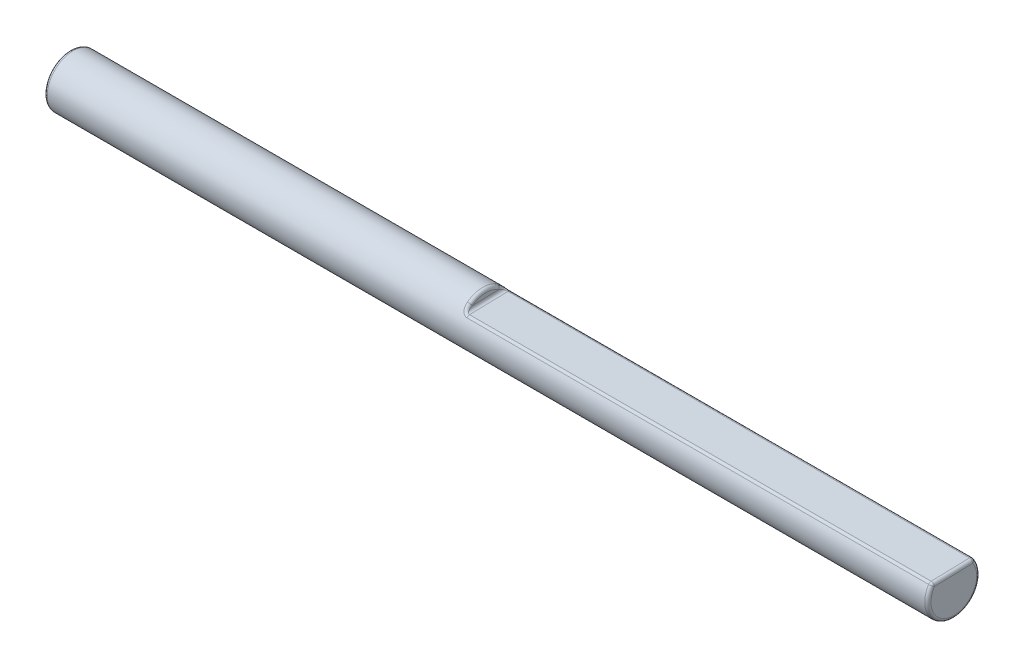
ISO-10303-21;
HEADER;
FILE_DESCRIPTION(('STEP AP214'),'2;1');
FILE_NAME('part.step','',(''),(''),'','','');
FILE_SCHEMA(('AUTOMOTIVE_DESIGN { 1 0 10303 214 1 1 1 1 }'));
ENDSEC;
DATA;
#1=APPLICATION_CONTEXT('core data for automotive mechanical design processes');
#2=APPLICATION_PROTOCOL_DEFINITION('international standard','automotive_design',2000,#1);
#3=PRODUCT_CONTEXT('',#1,'mechanical');
#4=PRODUCT('Part','Part','',(#3));
#5=PRODUCT_RELATED_PRODUCT_CATEGORY('part','',(#4));
#6=PRODUCT_DEFINITION_FORMATION('','',#4);
#7=PRODUCT_DEFINITION_CONTEXT('part definition',#1,'design');
#8=PRODUCT_DEFINITION('design','',#6,#7);
#9=PRODUCT_DEFINITION_SHAPE('','',#8);
#10=(LENGTH_UNIT() NAMED_UNIT(*) SI_UNIT(.MILLI.,.METRE.));
#11=(NAMED_UNIT(*) PLANE_ANGLE_UNIT() SI_UNIT($,.RADIAN.));
#12=(NAMED_UNIT(*) SI_UNIT($,.STERADIAN.) SOLID_ANGLE_UNIT());
#13=UNCERTAINTY_MEASURE_WITH_UNIT(LENGTH_MEASURE(1.E-05),#10,'distance_accuracy_value','');
#14=(GEOMETRIC_REPRESENTATION_CONTEXT(3) GLOBAL_UNCERTAINTY_ASSIGNED_CONTEXT((#13)) GLOBAL_UNIT_ASSIGNED_CONTEXT((#10,
#11,#12)) REPRESENTATION_CONTEXT('',''));
#15=CARTESIAN_POINT('',(0.,0.,0.));
#16=DIRECTION('',(0.,0.,1.));
#17=DIRECTION('',(1.,0.,0.));
#18=AXIS2_PLACEMENT_3D('',#15,#16,#17);
#19=CARTESIAN_POINT('',(107.95,0.,0.));
#20=DIRECTION('',(-1.,0.,0.));
#21=DIRECTION('',(0.,0.,1.));
#22=AXIS2_PLACEMENT_3D('',#19,#20,#21);
#23=CYLINDRICAL_SURFACE('',#22,3.175);
#24=CARTESIAN_POINT('',(0.381000000000006,0.,0.));
#25=DIRECTION('',(1.,0.,0.));
#26=DIRECTION('',(0.,0.,-1.));
#27=AXIS2_PLACEMENT_3D('',#24,#25,#26);
#28=CIRCLE('',#27,3.175);
#29=CARTESIAN_POINT('',(0.381000000000006,0.,-3.175));
#30=VERTEX_POINT('',#29);
#31=EDGE_CURVE('E273',#30,#30,#28,.T.);
#32=ORIENTED_EDGE('',*,*,#31,.T.);
#33=EDGE_LOOP('',(#32));
#34=FACE_BOUND('',#33,.T.);
#35=CARTESIAN_POINT('',(51.2889113464813,1.86061677622849,2.36945052063749));
#36=CARTESIAN_POINT('',(51.3264620396878,1.8664609920511,2.57606934951021));
#37=CARTESIAN_POINT('',(51.3968226929626,1.69924548178732,2.68201226556207));
#38=CARTESIAN_POINT('',(51.2716276856336,1.85531270441578,2.37616676666429));
#39=CARTESIAN_POINT('',(51.303375282423,1.85749105612046,2.58277024156461));
#40=CARTESIAN_POINT('',(51.3622553712666,1.68738842412367,2.68949626337339));
#41=CARTESIAN_POINT('',(51.253810924238,1.85128223441124,2.38121692365727));
#42=CARTESIAN_POINT('',(51.2793882237581,1.85068500253967,2.58781753681003));
#43=CARTESIAN_POINT('',(51.3266218484758,1.67837691595813,2.69512250049785));
#44=CARTESIAN_POINT('',(51.2176628451154,1.84587687221378,2.38795387459997));
#45=CARTESIAN_POINT('',(51.2306157818434,1.84157359403442,2.59454953766819));
#46=CARTESIAN_POINT('',(51.254325690231,1.66629032446794,2.70262711959848));
#47=CARTESIAN_POINT('',(51.1993321068419,1.84449910257518,2.38964431297881));
#48=CARTESIAN_POINT('',(51.2058012442463,1.83925197265389,2.59624634845099));
#49=CARTESIAN_POINT('',(51.2176642136843,1.66320880874467,2.70450956262816));
#50=CARTESIAN_POINT('',(51.1624786529568,1.84449552930852,2.38964534121022));
#51=CARTESIAN_POINT('',(51.1559427111945,1.83924541956583,2.59624879138466));
#52=CARTESIAN_POINT('',(51.143957305913,1.66320071994776,2.70451062871122));
#53=CARTESIAN_POINT('',(51.1439559089441,1.84589828072248,2.3879208611442));
#54=CARTESIAN_POINT('',(51.1308680865988,1.84160861468443,2.59451922324205));
#55=CARTESIAN_POINT('',(51.1069118178863,1.66633801200165,2.70259019769311));
#56=CARTESIAN_POINT('',(51.1074745013587,1.85142600111972,2.38104446763984));
#57=CARTESIAN_POINT('',(51.0816486169153,1.85092869396238,2.58764220598248));
#58=CARTESIAN_POINT('',(51.0339490027194,1.67869857779526,2.69493054907568));
#59=CARTESIAN_POINT('',(51.0895156565798,1.8555500860408,2.37589366728384));
#60=CARTESIAN_POINT('',(51.0574728002052,1.85789594340085,2.5824870818938));
#61=CARTESIAN_POINT('',(50.9980313131668,1.68791987506303,2.68919257165323));
#62=CARTESIAN_POINT('',(51.0547078075911,1.86628287038285,2.36224541373698));
#63=CARTESIAN_POINT('',(51.0109290954819,1.87606450098341,2.56887370326151));
#64=CARTESIAN_POINT('',(50.928415615175,1.71191094840253,2.67398282988706));
#65=CARTESIAN_POINT('',(51.0378561737102,1.87288541272295,2.35375625136794));
#66=CARTESIAN_POINT('',(50.9885283498056,1.88727939537419,2.56040524868403));
#67=CARTESIAN_POINT('',(50.8947123473936,1.72666697481243,2.66452031537807));
#68=CARTESIAN_POINT('',(51.0056058699795,1.88824233783816,2.33353659065094));
#69=CARTESIAN_POINT('',(50.9461400200386,1.91343730516875,2.54031499979632));
#70=CARTESIAN_POINT('',(50.8302117399579,1.76097448524634,2.641971655952));
#71=CARTESIAN_POINT('',(50.9902095857453,1.89700017172521,2.32180089007985));
#72=CARTESIAN_POINT('',(50.9261330136026,1.92842247979147,2.52865914842708));
#73=CARTESIAN_POINT('',(50.7994191715348,1.7805336600944,2.62887969517106));
#74=CARTESIAN_POINT('',(50.9607241196294,1.91655090994752,2.29484670019643));
#75=CARTESIAN_POINT('',(50.8885031415294,1.96198733713377,2.50200106090461));
#76=CARTESIAN_POINT('',(50.740448239213,1.82417519910743,2.59879421738565));
#77=CARTESIAN_POINT('',(50.9466938216674,1.92740079294856,2.27952725029035));
#78=CARTESIAN_POINT('',(50.8709667890501,1.98071569139524,2.48686134279981));
#79=CARTESIAN_POINT('',(50.7123876431477,1.84838410573956,2.58168754224174));
#80=CARTESIAN_POINT('',(50.92069636433,1.95044233090003,2.24590286258762));
#81=CARTESIAN_POINT('',(50.8394282094077,2.02063141439924,2.45378195785048));
#82=CARTESIAN_POINT('',(50.660392728466,1.89976428689574,2.54411811476548));
#83=CARTESIAN_POINT('',(50.90873157848,1.96263550345286,2.22759453657761));
#84=CARTESIAN_POINT('',(50.8254278039632,2.04188053771935,2.43578407032227));
#85=CARTESIAN_POINT('',(50.6364631569006,1.92693891165497,2.52365155349101));
#86=CARTESIAN_POINT('',(50.8827938803284,1.99264886394887,2.1808885782048));
#87=CARTESIAN_POINT('',(50.7964779101286,2.0944753687885,2.38998506591887));
#88=CARTESIAN_POINT('',(50.5845877607386,1.99378163171356,2.47140825448484));
#89=CARTESIAN_POINT('',(50.8697674359335,2.01085591234255,2.15129100670113));
#90=CARTESIAN_POINT('',(50.7832722093846,2.12660683697859,2.36102216723602));
#91=CARTESIAN_POINT('',(50.5585348718877,2.03429405335518,2.43827823086114));
#92=CARTESIAN_POINT('',(50.8474914781523,2.04782943375369,2.08793927786675));
#93=CARTESIAN_POINT('',(50.763655442702,2.1921565369996,2.29941171032207));
#94=CARTESIAN_POINT('',(50.5139829562839,2.11646998902107,2.36730788375925));
#95=CARTESIAN_POINT('',(50.8382463028738,2.06659652295876,2.05418040386822));
#96=CARTESIAN_POINT('',(50.7573419075053,2.22571762123843,2.26658152208576));
#97=CARTESIAN_POINT('',(50.4954926057465,2.1581347669446,2.32946221475156));
#98=CARTESIAN_POINT('',(50.8200767324406,2.11127559581753,1.96934888447875));
#99=CARTESIAN_POINT('',(50.7495916814408,2.30634325466988,2.18416014327291));
#100=CARTESIAN_POINT('',(50.4591534648827,2.25719798063517,2.23428957702656));
#101=CARTESIAN_POINT('',(50.8127131041597,2.13709014841927,1.91669422351017));
#102=CARTESIAN_POINT('',(50.7514088708258,2.35328761028631,2.1331392674937));
#103=CARTESIAN_POINT('',(50.4444262082862,2.31432941245922,2.17516089294884));
#104=CARTESIAN_POINT('',(50.8029629166156,2.18716484872636,1.80640004855309));
#105=CARTESIAN_POINT('',(50.7649453938521,2.44503082507211,2.02690729169339));
#106=CARTESIAN_POINT('',(50.4249258332647,2.42491686404693,2.05119042107963));
#107=CARTESIAN_POINT('',(50.8006063710277,2.21141478255827,1.74873261886379));
#108=CARTESIAN_POINT('',(50.7771512057677,2.48993644770661,1.97126510354332));
#109=CARTESIAN_POINT('',(50.4202127421912,2.47834887258039,1.9863165957711));
#110=CARTESIAN_POINT('',(50.7996997300512,2.25308918931056,1.64154501717415));
#111=CARTESIAN_POINT('',(50.8063065780548,2.5675813512571,1.86856339253273));
#112=CARTESIAN_POINT('',(50.4183994599932,2.56994052925047,1.86563624935162));
#113=CARTESIAN_POINT('',(50.8004940123679,2.27091978608572,1.59264377162257));
#114=CARTESIAN_POINT('',(50.8222093303457,2.60124831444893,1.82140194567038));
#115=CARTESIAN_POINT('',(50.4199880243634,2.60904074450168,1.81054522403829));
#116=CARTESIAN_POINT('',(50.8038892506501,2.30498944125461,1.49291444033795));
#117=CARTESIAN_POINT('',(50.8585085124755,2.66631382468721,1.72508979460887));
#118=CARTESIAN_POINT('',(50.4267785009295,2.68356961941779,1.69812625423315));
#119=CARTESIAN_POINT('',(50.8064925353414,2.32122641740139,1.44208395091787));
#120=CARTESIAN_POINT('',(50.8791200444994,2.69765457973563,1.67579499349746));
#121=CARTESIAN_POINT('',(50.4319850705777,2.718993478883,1.64079551644433));
#122=CARTESIAN_POINT('',(50.8129252595926,2.35173838787002,1.33979125008394));
#123=CARTESIAN_POINT('',(50.9236828364736,2.75740753118696,1.57615280226639));
#124=CARTESIAN_POINT('',(50.4448505192883,2.78536536104796,1.52535910882584));
#125=CARTESIAN_POINT('',(50.8167316771751,2.36604354938308,1.28835707996335));
#126=CARTESIAN_POINT('',(50.9477540223914,2.78579308492648,1.52569960894811));
#127=CARTESIAN_POINT('',(50.4524633544017,2.81638273242603,1.46728619497698));
#128=CARTESIAN_POINT('',(50.8251335397235,2.3929742143745,1.18429308388462));
#129=CARTESIAN_POINT('',(50.9988637336602,2.84029317299343,1.42251192748724));
#130=CARTESIAN_POINT('',(50.4692670793957,2.87456680695641,1.34973233304561));
#131=CARTESIAN_POINT('',(50.8297267183352,2.40560436247825,1.13166705892288));
#132=CARTESIAN_POINT('',(51.0260182991249,2.86629149250079,1.36970693172966));
#133=CARTESIAN_POINT('',(50.4784534365679,2.90174417233005,1.29025584106035));
#134=CARTESIAN_POINT('',(50.8345010351724,2.41740942277435,1.07845527244791));
#135=CARTESIAN_POINT('',(51.053542503335,2.89057483799126,1.31683559197639));
#136=CARTESIAN_POINT('',(50.4880020703448,2.92703004363376,1.23008947791018));
#137=(BOUNDED_SURFACE() B_SPLINE_SURFACE(3,2,((#35,#36,#37),(#38,#39,#40),(#41,#42,#43),(#44,
#45,#46),(#47,#48,#49),(#50,#51,#52),(#53,#54,#55),(#56,#57,#58),(#59,#60,#61),(#62,#63,#64),
(#65,#66,#67),(#68,#69,#70),(#71,#72,#73),(#74,#75,#76),(#77,#78,#79),(#80,#81,#82),(#83,#84,
#85),(#86,#87,#88),(#89,#90,#91),(#92,#93,#94),(#95,#96,#97),(#98,#99,#100),(#101,#102,#103),
(#104,#105,#106),(#107,#108,#109),(#110,#111,#112),(#113,#114,#115),(#116,#117,#118),(#119,#120,
#121),(#122,#123,#124),(#125,#126,#127),(#128,#129,#130),(#131,#132,#133),(#134,#135,#136)),
.UNSPECIFIED.,.F.,.F.,.F.) B_SPLINE_SURFACE_WITH_KNOTS((4,2,2,2,2,2,2,2,2,2,2,2,2,2,2,2,4),(3,
3),(0.,0.109979605014101,0.219839845237583,0.330834159910739,0.441792434311733,
0.552476866686738,0.663339696503116,0.777812327617677,0.892415638572016,1.05027319729736,
1.20831135545631,1.42859982924447,1.65020508343154,1.82836901100806,2.00676271461984,
2.18193077376075,2.35660247596007),(0.,1.),
.UNSPECIFIED.) GEOMETRIC_REPRESENTATION_ITEM() RATIONAL_B_SPLINE_SURFACE(((1.,0.875696525181189,
1.),(1.,0.876819204022841,1.),(1.,0.877647414738648,1.),(1.,0.87874140112617,1.),(1.,
0.87900778625312,1.),(1.,0.879006937081256,1.),(1.,0.878734165904822,1.),(1.,0.877621403045872,
1.),(1.,0.876781595570751,1.),(1.,0.874483221090066,1.),(1.,0.873026186281496,1.),(1.,
0.869421553804353,1.),(1.,0.867272846894886,1.),(1.,0.862141294560382,1.),(1.,0.859133566871117,
1.),(1.,0.852278123703959,1.),(1.,0.848429453231229,1.),(1.,0.838277208471231,1.),(1.,
0.831595334164917,1.),(1.,0.816756892948541,1.),(1.,0.808598647638926,1.),(1.,0.78754094815492,
1.),(1.,0.774039732630418,1.),(1.,0.745150665958184,1.),(1.,0.729752019803922,1.),(1.,
0.700926713202263,1.),(1.,0.687705220781478,1.),(1.,0.660816578297559,1.),(1.,0.647148875465996,
1.),(1.,0.619959656878175,1.),(1.,0.60643996640438,1.),(1.,0.579679073015139,1.),(1.,
0.566437189530008,1.),(1.,0.553482817324469,1.))) REPRESENTATION_ITEM('') SURFACE());
#138=CARTESIAN_POINT('',(50.4880020703448,2.92703004363376,1.23008947791018));
#139=CARTESIAN_POINT('',(50.4784534365679,2.90174417233005,1.29025584106035));
#140=CARTESIAN_POINT('',(50.4692670793957,2.87456680695641,1.34973233304561));
#141=CARTESIAN_POINT('',(50.4524633544017,2.81638273242603,1.46728619497698));
#142=CARTESIAN_POINT('',(50.4448505192883,2.78536536104796,1.52535910882584));
#143=CARTESIAN_POINT('',(50.4319850705777,2.71899347888301,1.64079551644433));
#144=CARTESIAN_POINT('',(50.4267785009295,2.68356961941779,1.69812625423315));
#145=CARTESIAN_POINT('',(50.4199880243634,2.60904074450168,1.81054522403829));
#146=CARTESIAN_POINT('',(50.4183994599932,2.56994052925047,1.86563624935162));
#147=CARTESIAN_POINT('',(50.4202127421912,2.47834887258039,1.9863165957711));
#148=CARTESIAN_POINT('',(50.4249258332647,2.42491686404693,2.05119042107963));
#149=CARTESIAN_POINT('',(50.4444262082862,2.31432941245922,2.17516089294884));
#150=CARTESIAN_POINT('',(50.4591534648827,2.25719798063517,2.23428957702656));
#151=CARTESIAN_POINT('',(50.4954926057465,2.1581347669446,2.32946221475156));
#152=CARTESIAN_POINT('',(50.5139829562839,2.11646998902107,2.36730788375925));
#153=CARTESIAN_POINT('',(50.5585348718877,2.03429405335518,2.43827823086114));
#154=CARTESIAN_POINT('',(50.5845877607386,1.99378163171356,2.47140825448484));
#155=CARTESIAN_POINT('',(50.6364631569006,1.92693891165497,2.52365155349101));
#156=CARTESIAN_POINT('',(50.660392728466,1.89976428689574,2.54411811476548));
#157=CARTESIAN_POINT('',(50.7123876431477,1.84838410573956,2.58168754224174));
#158=CARTESIAN_POINT('',(50.740448239213,1.82417519910743,2.59879421738565));
#159=CARTESIAN_POINT('',(50.7994191715348,1.7805336600944,2.62887969517106));
#160=CARTESIAN_POINT('',(50.8302117399579,1.76097448524634,2.641971655952));
#161=CARTESIAN_POINT('',(50.8947123473936,1.72666697481243,2.66452031537807));
#162=CARTESIAN_POINT('',(50.928415615175,1.71191094840253,2.67398282988706));
#163=CARTESIAN_POINT('',(50.9980313131668,1.68791987506303,2.68919257165323));
#164=CARTESIAN_POINT('',(51.0339490027194,1.67869857779526,2.69493054907568));
#165=CARTESIAN_POINT('',(51.1069118178863,1.66633801200165,2.70259019769311));
#166=CARTESIAN_POINT('',(51.143957305913,1.66320071994776,2.70451062871122));
#167=CARTESIAN_POINT('',(51.2176642136843,1.66320880874467,2.70450956262816));
#168=CARTESIAN_POINT('',(51.254325690231,1.66629032446794,2.70262711959848));
#169=CARTESIAN_POINT('',(51.3266218484758,1.67837691595813,2.69512250049785));
#170=CARTESIAN_POINT('',(51.3622553712666,1.68738842412367,2.68949626337339));
#171=CARTESIAN_POINT('',(51.3968226929626,1.69924548178732,2.68201226556207));
#172=B_SPLINE_CURVE_WITH_KNOTS('',3,(#138,#139,#140,#141,#142,#143,#144,#145,#146,#147,#148,
#149,#150,#151,#152,#153,#154,#155,#156,#157,#158,#159,#160,#161,#162,#163,#164,#165,#166,#167,
#168,#169,#170,#171),.UNSPECIFIED.,.F.,.F.,(4,2,2,2,2,2,2,2,2,2,2,2,2,2,2,2,4),(0.,
0.174671702199319,0.349839761340232,0.52823346495201,0.706397392528534,0.928002646715598,
1.14829112050376,1.30632927866271,1.46418683738806,1.5787901483424,1.69326277945696,
1.80412560927333,1.91481004164834,2.02576831604933,2.13676263072249,2.24662287094597,
2.35660247596007),.UNSPECIFIED.);
#173=CARTESIAN_POINT('',(50.419,2.55004648338834,1.89153057933484));
#174=VERTEX_POINT('',#173);
#175=CARTESIAN_POINT('',(51.181,1.66320478511395,2.70451009293255));
#176=VERTEX_POINT('',#175);
#177=EDGE_CURVE('E267',#174,#176,#172,.T.);
#178=ORIENTED_EDGE('',*,*,#177,.F.);
#179=CARTESIAN_POINT('',(50.419,0.,0.));
#180=DIRECTION('',(-1.,0.,0.));
#181=DIRECTION('',(0.,0.,1.));
#182=AXIS2_PLACEMENT_3D('',#179,#180,#181);
#183=CIRCLE('',#182,3.175);
#184=CARTESIAN_POINT('',(50.419,2.64280139391695,-1.75960955677975));
#185=VERTEX_POINT('',#184);
#186=EDGE_CURVE('E103',#174,#185,#183,.T.);
#187=ORIENTED_EDGE('',*,*,#186,.T.);
#188=CARTESIAN_POINT('',(50.8366905023827,2.47313278792479,-0.929790084784356));
#189=CARTESIAN_POINT('',(51.0664734733044,2.96369122443615,-1.14301851228131));
#190=CARTESIAN_POINT('',(50.4923810047653,2.99569537312775,-1.05187177518031));
#191=CARTESIAN_POINT('',(50.8319019684397,2.46437474302006,-0.983264972040821));
#192=CARTESIAN_POINT('',(51.0388431863217,2.94265705359688,-1.19707037018806));
#193=CARTESIAN_POINT('',(50.4828039368059,2.9742543950184,-1.11293055452863));
#194=CARTESIAN_POINT('',(50.8272624690788,2.45477757696794,-1.03621001373454));
#195=CARTESIAN_POINT('',(51.0115031225493,2.91994457885805,-1.25108863702687));
#196=CARTESIAN_POINT('',(50.4735249381208,2.95092222441763,-1.17341105694561));
#197=CARTESIAN_POINT('',(50.8186892705911,2.43388562169779,-1.14102346267586));
#198=CARTESIAN_POINT('',(50.9598467979093,2.87193959302793,-1.35678020802059));
#199=CARTESIAN_POINT('',(50.4563785412191,2.90043195384652,-1.29319680086037));
#200=CARTESIAN_POINT('',(50.8147573756501,2.42258662422196,-1.19288882775468));
#201=CARTESIAN_POINT('',(50.9354262066966,2.84677023994149,-1.40851008729006));
#202=CARTESIAN_POINT('',(50.4485147513741,2.87326438050473,-1.35249870452667));
#203=CARTESIAN_POINT('',(50.8079566034907,2.39803114103891,-1.29645583950263));
#204=CARTESIAN_POINT('',(50.8898623196213,2.79330806338998,-1.51110560413029));
#205=CARTESIAN_POINT('',(50.4349132069055,2.8144865549075,-1.47097282171677));
#206=CARTESIAN_POINT('',(50.8051148175835,2.38473496399274,-1.34812512319508));
#207=CARTESIAN_POINT('',(50.8686188962066,2.76503432555879,-1.56206901829057));
#208=CARTESIAN_POINT('',(50.4292296348989,2.78278705782587,-1.53010938050571));
#209=CARTESIAN_POINT('',(50.8011384346416,2.35644960446841,-1.44969228552826));
#210=CARTESIAN_POINT('',(50.8308901831387,2.70598038527811,-1.66187338182173));
#211=CARTESIAN_POINT('',(50.4212768690133,2.71559266983258,-1.64641708269041));
#212=CARTESIAN_POINT('',(50.8000019744405,2.34146228894075,-1.49959203917676));
#213=CARTESIAN_POINT('',(50.8141969196926,2.67527084306931,-1.71084799126658));
#214=CARTESIAN_POINT('',(50.4190039488012,2.68010196652802,-1.70359030428956));
#215=CARTESIAN_POINT('',(50.7999972238099,2.30345354349339,-1.61716285052348));
#216=CARTESIAN_POINT('',(50.7808943816749,2.59910537279674,-1.82523082391367));
#217=CARTESIAN_POINT('',(50.4189944477321,2.59035439555285,-1.83837622007862));
#218=CARTESIAN_POINT('',(50.8022373446047,2.27964097768128,-1.68382232215996));
#219=CARTESIAN_POINT('',(50.766210276487,2.55198508508872,-1.8908185457887));
#220=CARTESIAN_POINT('',(50.4234746892161,2.53432925583875,-1.91486146749265));
#221=CARTESIAN_POINT('',(50.8130834683634,2.2297090887604,-1.81076112732047));
#222=CARTESIAN_POINT('',(50.7507213830287,2.45497751815753,-2.01558647679361));
#223=CARTESIAN_POINT('',(50.4451669367202,2.4172221038779,-2.06064367928652));
#224=CARTESIAN_POINT('',(50.8216317880889,2.20361254448583,-1.87109265147976));
#225=CARTESIAN_POINT('',(50.7491923300968,2.40498959580597,-2.07538897589359));
#226=CARTESIAN_POINT('',(50.4622635762618,2.35619033931358,-2.12999933228784));
#227=CARTESIAN_POINT('',(50.841931751241,2.16135772100504,-1.96069216875758));
#228=CARTESIAN_POINT('',(50.7597988918809,2.32503752005264,-2.1646831757065));
#229=CARTESIAN_POINT('',(50.5028635024318,2.25760267407526,-2.2331016851402));
#230=CARTESIAN_POINT('',(50.8510161119943,2.14541948765644,-1.99270116650551));
#231=CARTESIAN_POINT('',(50.7665067335088,2.29530187505624,-2.19654788923173));
#232=CARTESIAN_POINT('',(50.5210322238258,2.22046763862043,-2.2699588237116));
#233=CARTESIAN_POINT('',(50.8725439006968,2.11390174586578,-2.05301756447317));
#234=CARTESIAN_POINT('',(50.7860729430861,2.23711937049072,-2.25663718827951));
#235=CARTESIAN_POINT('',(50.5640878013179,2.14711938041226,-2.33945367830609));
#236=CARTESIAN_POINT('',(50.8849895631031,2.09832248355702,-2.08132248372334));
#237=CARTESIAN_POINT('',(50.7988658365802,2.20856141987183,-2.2850125711189));
#238=CARTESIAN_POINT('',(50.5889791263305,2.1109067884488,-2.37208856612658));
#239=CARTESIAN_POINT('',(50.9135672484879,2.06823964868464,-2.13365896718704));
#240=CARTESIAN_POINT('',(50.8308512970163,2.15398855389044,-2.33751986989062));
#241=CARTESIAN_POINT('',(50.6461344968504,2.0410488499449,-2.43246808970737));
#242=CARTESIAN_POINT('',(50.9297340159478,2.05374803932415,-2.15764619565517));
#243=CARTESIAN_POINT('',(50.8500787265335,2.12786952256222,-2.36175791806184));
#244=CARTESIAN_POINT('',(50.678468031314,2.00743196280211,-2.46016196629496));
#245=CARTESIAN_POINT('',(50.9655460143898,2.02707924621252,-2.20021747230689));
#246=CARTESIAN_POINT('',(50.8944279737883,2.0802717739033,-2.4047987145019));
#247=CARTESIAN_POINT('',(50.7500920281881,1.94561243483343,-2.50933901244598));
#248=CARTESIAN_POINT('',(50.9851874844033,2.01489958929147,-2.21880730566401));
#249=CARTESIAN_POINT('',(50.9195598483639,2.05866695165713,-2.42372852510654));
#250=CARTESIAN_POINT('',(50.7893749686602,1.91740400807438,-2.53082883165927));
#251=CARTESIAN_POINT('',(51.0242849184163,1.99544826213891,-2.24772736525183));
#252=CARTESIAN_POINT('',(50.9705605778029,2.02442613620939,-2.45319434086187));
#253=CARTESIAN_POINT('',(50.8675698369576,1.87237635998464,-2.56427490238752));
#254=CARTESIAN_POINT('',(51.0433501238559,1.98771985118057,-2.25886680651986));
#255=CARTESIAN_POINT('',(50.9958022438088,2.01089078633314,-2.46459856468082));
#256=CARTESIAN_POINT('',(50.905700247744,1.85449608074485,-2.57716448670486));
#257=CARTESIAN_POINT('',(51.082987248131,1.97527835310497,-2.27655087496051));
#258=CARTESIAN_POINT('',(51.0486832725315,1.98920693919082,-2.48269898626542));
#259=CARTESIAN_POINT('',(50.9849744962274,1.82571888208067,-2.59763191682843));
#260=CARTESIAN_POINT('',(51.1035575481574,1.97056207790239,-2.2831003609211));
#261=CARTESIAN_POINT('',(51.0763622895416,1.98101447009375,-2.48943280879809));
#262=CARTESIAN_POINT('',(51.026115096306,1.81481457916767,-2.60521537952105));
#263=CARTESIAN_POINT('',(51.1428554608013,1.96486509340047,-2.29097794114208));
#264=CARTESIAN_POINT('',(51.1293797388771,1.97114341042692,-2.49752366762619));
#265=CARTESIAN_POINT('',(51.1047109216102,1.80164379466081,-2.6143373069388));
#266=CARTESIAN_POINT('',(51.1614979032267,1.96349577240607,-2.29284986576948));
#267=CARTESIAN_POINT('',(51.15461567683,1.96877450701537,-2.49945091695443));
#268=CARTESIAN_POINT('',(51.1419958064556,1.79847870003612,-2.61650537079105));
#269=CARTESIAN_POINT('',(51.198800323664,1.96341522144709,-2.29296003419046));
#270=CARTESIAN_POINT('',(51.2050815462412,1.9686350523109,-2.49956438992405));
#271=CARTESIAN_POINT('',(51.2166006473259,1.79829251030992,-2.61663296676295));
#272=CARTESIAN_POINT('',(51.2174603047176,1.9647046013986,-2.29119744421257));
#273=CARTESIAN_POINT('',(51.2303432902503,1.9708653804644,-2.49774989809651));
#274=CARTESIAN_POINT('',(51.2539206094347,1.80127282498867,-2.61459153320788));
#275=CARTESIAN_POINT('',(51.2535558495348,1.96978030577213,-2.28418358195071));
#276=CARTESIAN_POINT('',(51.2790431839511,1.97965862877354,-2.49054565618816));
#277=CARTESIAN_POINT('',(51.3261116990702,1.81300714649384,-2.60646966065092));
#278=CARTESIAN_POINT('',(51.2710113390765,1.97347575155864,-2.27905923384329));
#279=CARTESIAN_POINT('',(51.3025438737369,1.98607456474883,-2.48527719823452));
#280=CARTESIAN_POINT('',(51.3610226781532,1.82155101581374,-2.60053616854032));
#281=CARTESIAN_POINT('',(51.3049460682606,1.98305049522653,-2.26552764164808));
#282=CARTESIAN_POINT('',(51.3479419425349,2.00273634474729,-2.47142162312479));
#283=CARTESIAN_POINT('',(51.4288921365209,1.8436951655787,-2.58487321052664));
#284=CARTESIAN_POINT('',(51.3214252853435,1.98892984355043,-2.25712032173186));
#285=CARTESIAN_POINT('',(51.3698657559731,2.01300308331627,-2.46281679159412));
#286=CARTESIAN_POINT('',(51.4618505706864,1.85729556281653,-2.57514365694404));
#287=CARTESIAN_POINT('',(51.3371917565338,1.99578921052919,-2.24711140873195));
#288=CARTESIAN_POINT('',(51.3905745844236,2.0250108878266,-2.45261527789264));
#289=CARTESIAN_POINT('',(51.4933835130676,1.87316876284834,-2.56356466387903));
#290=(BOUNDED_SURFACE() B_SPLINE_SURFACE(3,2,((#188,#189,#190),(#191,#192,#193),(#194,#195,
#196),(#197,#198,#199),(#200,#201,#202),(#203,#204,#205),(#206,#207,#208),(#209,#210,#211),
(#212,#213,#214),(#215,#216,#217),(#218,#219,#220),(#221,#222,#223),(#224,#225,#226),(#227,#228,
#229),(#230,#231,#232),(#233,#234,#235),(#236,#237,#238),(#239,#240,#241),(#242,#243,#244),
(#245,#246,#247),(#248,#249,#250),(#251,#252,#253),(#254,#255,#256),(#257,#258,#259),(#260,#261,
#262),(#263,#264,#265),(#266,#267,#268),(#269,#270,#271),(#272,#273,#274),(#275,#276,#277),
(#278,#279,#280),(#281,#282,#283),(#284,#285,#286),(#287,#288,#289)),.UNSPECIFIED.,.F.,.F.,
.F.) B_SPLINE_SURFACE_WITH_KNOTS((4,2,2,2,2,2,2,2,2,2,2,2,2,2,2,2,4),(3,3),(0.,
0.173248836944608,0.346933335867547,0.524690929361412,0.70225417070621,0.951919480819183,
1.19932966387977,1.34732751797523,1.49542399824134,1.64496379912425,1.79434271967722,
1.92193480842236,2.04939162718749,2.16114701727452,2.27292804732529,2.3807144182394,
2.48850327889578),(0.,1.),
.UNSPECIFIED.) GEOMETRIC_REPRESENTATION_ITEM() RATIONAL_B_SPLINE_SURFACE(((1.,0.547606480192874,
1.),(1.,0.560359682932015,1.),(1.,0.573424936455796,1.),(1.,0.599879323130063,1.),(1.,
0.613269188109451,1.),(1.,0.640318570500402,1.),(1.,0.653977047742925,1.),(1.,0.680906548091395,
1.),(1.,0.694177978494561,1.),(1.,0.725285507307095,1.),(1.,0.742786852814231,1.),(1.,
0.775341861423871,1.),(1.,0.790416205566558,1.),(1.,0.811926405637071,1.),(1.,0.819399514188753,
1.),(1.,0.833048896557436,1.),(1.,0.839224302841506,1.),(1.,0.850224407389941,1.),(1.,
0.855035355360919,1.),(1.,0.86323283357083,1.),(1.,0.866620890681609,1.),(1.,0.871698951997393,
1.),(1.,0.873564545316049,1.),(1.,0.876457776981406,1.),(1.,0.877486301610389,1.),(1.,
0.87871348011476,1.),(1.,0.878998757213615,1.),(1.,0.879015583797091,1.),(1.,0.878747006225343,
1.),(1.,0.877655652456154,1.),(1.,0.876853024358936,1.),(1.,0.874661101921426,1.),(1.,
0.873271794030241,1.),(1.,0.871562708712588,1.))) REPRESENTATION_ITEM('') SURFACE());
#291=CARTESIAN_POINT('',(51.4933835130676,1.87316876284834,-2.56356466387903));
#292=CARTESIAN_POINT('',(51.4618505706864,1.85729556281653,-2.57514365694404));
#293=CARTESIAN_POINT('',(51.4288921365209,1.8436951655787,-2.58487321052664));
#294=CARTESIAN_POINT('',(51.3610226781532,1.82155101581374,-2.60053616854032));
#295=CARTESIAN_POINT('',(51.3261116990702,1.81300714649384,-2.60646966065092));
#296=CARTESIAN_POINT('',(51.2539206094347,1.80127282498867,-2.61459153320788));
#297=CARTESIAN_POINT('',(51.2166006473259,1.79829251030992,-2.61663296676295));
#298=CARTESIAN_POINT('',(51.1419958064556,1.79847870003612,-2.61650537079105));
#299=CARTESIAN_POINT('',(51.1047109216102,1.80164379466081,-2.6143373069388));
#300=CARTESIAN_POINT('',(51.026115096306,1.81481457916767,-2.60521537952105));
#301=CARTESIAN_POINT('',(50.9849744962274,1.82571888208067,-2.59763191682843));
#302=CARTESIAN_POINT('',(50.905700247744,1.85449608074485,-2.57716448670486));
#303=CARTESIAN_POINT('',(50.8675698369576,1.87237635998464,-2.56427490238752));
#304=CARTESIAN_POINT('',(50.7893749686602,1.91740400807438,-2.53082883165927));
#305=CARTESIAN_POINT('',(50.7500920281881,1.94561243483343,-2.50933901244598));
#306=CARTESIAN_POINT('',(50.678468031314,2.00743196280211,-2.46016196629496));
#307=CARTESIAN_POINT('',(50.6461344968504,2.0410488499449,-2.43246808970737));
#308=CARTESIAN_POINT('',(50.5889791263305,2.1109067884488,-2.37208856612658));
#309=CARTESIAN_POINT('',(50.5640878013179,2.14711938041226,-2.33945367830609));
#310=CARTESIAN_POINT('',(50.5210322238258,2.22046763862043,-2.2699588237116));
#311=CARTESIAN_POINT('',(50.5028635024318,2.25760267407526,-2.2331016851402));
#312=CARTESIAN_POINT('',(50.4622635762618,2.35619033931357,-2.12999933228784));
#313=CARTESIAN_POINT('',(50.4451669367202,2.4172221038779,-2.06064367928652));
#314=CARTESIAN_POINT('',(50.4234746892161,2.53432925583875,-1.91486146749265));
#315=CARTESIAN_POINT('',(50.4189944477321,2.59035439555285,-1.83837622007862));
#316=CARTESIAN_POINT('',(50.4190039488012,2.68010196652802,-1.70359030428956));
#317=CARTESIAN_POINT('',(50.4212768690133,2.71559266983258,-1.64641708269041));
#318=CARTESIAN_POINT('',(50.4292296348989,2.78278705782587,-1.53010938050571));
#319=CARTESIAN_POINT('',(50.4349132069055,2.8144865549075,-1.47097282171677));
#320=CARTESIAN_POINT('',(50.4485147513741,2.87326438050473,-1.35249870452667));
#321=CARTESIAN_POINT('',(50.4563785412191,2.90043195384652,-1.29319680086037));
#322=CARTESIAN_POINT('',(50.4735249381208,2.95092222441763,-1.17341105694561));
#323=CARTESIAN_POINT('',(50.4828039368059,2.9742543950184,-1.11293055452863));
#324=CARTESIAN_POINT('',(50.4923810047653,2.99569537312775,-1.05187177518031));
#325=B_SPLINE_CURVE_WITH_KNOTS('',3,(#291,#292,#293,#294,#295,#296,#297,#298,#299,#300,#301,
#302,#303,#304,#305,#306,#307,#308,#309,#310,#311,#312,#313,#314,#315,#316,#317,#318,#319,#320,
#321,#322,#323,#324),.UNSPECIFIED.,.F.,.F.,(4,2,2,2,2,2,2,2,2,2,2,2,2,2,2,2,4),(0.,
0.107788860656389,0.215575231570491,0.327356261621264,0.43911165170829,0.566568470473421,
0.694160559218561,0.84353947977153,0.993079280654447,1.14117576092056,1.28917361501601,
1.5365837980766,1.78624910818957,1.96381234953437,2.14156994302824,2.31525444195118,
2.48850327889578),.UNSPECIFIED.);
#326=CARTESIAN_POINT('',(51.181,1.79838348211942,-2.61657062798619));
#327=VERTEX_POINT('',#326);
#328=EDGE_CURVE('E135',#327,#185,#325,.T.);
#329=ORIENTED_EDGE('',*,*,#328,.F.);
#330=DIRECTION('',(-1.,0.,0.));
#331=VECTOR('',#330,1.);
#332=CARTESIAN_POINT('',(107.95,1.79838348211942,-2.61657062798619));
#333=LINE('',#332,#331);
#334=CARTESIAN_POINT('',(107.569,1.79838348211942,-2.61657062798619));
#335=VERTEX_POINT('',#334);
#336=EDGE_CURVE('E133',#327,#335,#333,.F.);
#337=ORIENTED_EDGE('',*,*,#336,.T.);
#338=CARTESIAN_POINT('',(107.569,0.,0.));
#339=DIRECTION('',(1.,0.,0.));
#340=DIRECTION('',(0.,0.,-1.));
#341=AXIS2_PLACEMENT_3D('',#338,#339,#340);
#342=CIRCLE('',#341,3.175);
#343=CARTESIAN_POINT('',(107.569,1.66320478511395,2.70451009293255));
#344=VERTEX_POINT('',#343);
#345=EDGE_CURVE('E127',#335,#344,#342,.F.);
#346=ORIENTED_EDGE('',*,*,#345,.T.);
#347=DIRECTION('',(-1.,0.,0.));
#348=VECTOR('',#347,1.);
#349=CARTESIAN_POINT('',(107.95,1.66320478511395,2.70451009293255));
#350=LINE('',#349,#348);
#351=EDGE_CURVE('E129',#344,#176,#350,.T.);
#352=ORIENTED_EDGE('',*,*,#351,.T.);
#353=EDGE_LOOP('',(#178,#187,#329,#337,#346,#352));
#354=FACE_BOUND('',#353,.T.);
#355=ADVANCED_FACE('F34',(#34,#354),#23,.T.);
#356=CARTESIAN_POINT('',(107.95,0.,0.));
#357=DIRECTION('',(1.,0.,0.));
#358=DIRECTION('',(0.,0.,-1.));
#359=AXIS2_PLACEMENT_3D('',#356,#357,#358);
#360=PLANE('',#359);
#361=CARTESIAN_POINT('',(107.95,0.,0.));
#362=DIRECTION('',(1.,0.,0.));
#363=DIRECTION('',(0.,0.,-1.));
#364=AXIS2_PLACEMENT_3D('',#361,#362,#363);
#365=CIRCLE('',#364,2.794);
#366=CARTESIAN_POINT('',(107.95,1.46362021089986,2.37996888178091));
#367=VERTEX_POINT('',#366);
#368=CARTESIAN_POINT('',(107.95,1.58257746426468,-2.30258215262812));
#369=VERTEX_POINT('',#368);
#370=EDGE_CURVE('E43',#367,#369,#365,.T.);
#371=ORIENTED_EDGE('',*,*,#370,.T.);
#372=DIRECTION('',(0.,0.0253961749971585,-0.999677465133387));
#373=VECTOR('',#372,1.);
#374=CARTESIAN_POINT('',(107.95,1.45858474981178,2.57818128885724));
#375=LINE('',#374,#373);
#376=EDGE_CURVE('E11',#369,#367,#375,.F.);
#377=ORIENTED_EDGE('',*,*,#376,.T.);
#378=EDGE_LOOP('',(#371,#377));
#379=FACE_BOUND('',#378,.T.);
#380=ADVANCED_FACE('F151',(#379),#360,.T.);
#381=CARTESIAN_POINT('',(0.,0.,0.));
#382=DIRECTION('',(1.,0.,0.));
#383=DIRECTION('',(0.,0.,-1.));
#384=AXIS2_PLACEMENT_3D('',#381,#382,#383);
#385=PLANE('',#384);
#386=CARTESIAN_POINT('',(0.,0.,0.));
#387=DIRECTION('',(1.,0.,0.));
#388=DIRECTION('',(0.,0.,-1.));
#389=AXIS2_PLACEMENT_3D('',#386,#387,#388);
#390=CIRCLE('',#389,2.794);
#391=CARTESIAN_POINT('',(0.,0.,-2.794));
#392=VERTEX_POINT('',#391);
#393=EDGE_CURVE('E276',#392,#392,#390,.F.);
#394=ORIENTED_EDGE('',*,*,#393,.T.);
#395=EDGE_LOOP('',(#394));
#396=FACE_BOUND('',#395,.T.);
#397=ADVANCED_FACE('F153',(#396),#385,.F.);
#398=CARTESIAN_POINT('',(50.8,1.8394618640276,2.58785723153116));
#399=DIRECTION('',(0.,-0.999677465133387,-0.0253961749971585));
#400=DIRECTION('',(0.,0.0253961749971585,-0.999677465133387));
#401=AXIS2_PLACEMENT_3D('',#398,#399,#400);
#402=PLANE('',#401);
#403=DIRECTION('',(-1.,0.,0.));
#404=VECTOR('',#403,1.);
#405=CARTESIAN_POINT('',(50.8,1.96345457848091,-2.29290620995393));
#406=LINE('',#405,#404);
#407=CARTESIAN_POINT('',(107.569,1.96345457848091,-2.29290620995393));
#408=VERTEX_POINT('',#407);
#409=CARTESIAN_POINT('',(51.181,1.96345457848091,-2.29290620995393));
#410=VERTEX_POINT('',#409);
#411=EDGE_CURVE('E243',#408,#410,#406,.T.);
#412=ORIENTED_EDGE('',*,*,#411,.T.);
#413=DIRECTION('',(0.,0.0253961749971585,-0.999677465133387));
#414=VECTOR('',#413,1.);
#415=CARTESIAN_POINT('',(51.181,1.8394618640276,2.58785723153116));
#416=LINE('',#415,#414);
#417=CARTESIAN_POINT('',(51.181,1.8444973251161,2.38964482445456));
#418=VERTEX_POINT('',#417);
#419=EDGE_CURVE('E229',#410,#418,#416,.F.);
#420=ORIENTED_EDGE('',*,*,#419,.T.);
#421=DIRECTION('',(-1.,0.,0.));
#422=VECTOR('',#421,1.);
#423=CARTESIAN_POINT('',(50.8,1.8444973251161,2.38964482445456));
#424=LINE('',#423,#422);
#425=CARTESIAN_POINT('',(107.569,1.8444973251161,2.38964482445456));
#426=VERTEX_POINT('',#425);
#427=EDGE_CURVE('E246',#418,#426,#424,.F.);
#428=ORIENTED_EDGE('',*,*,#427,.T.);
#429=DIRECTION('',(0.,0.0253961749971585,-0.999677465133387));
#430=VECTOR('',#429,1.);
#431=CARTESIAN_POINT('',(107.569,1.9684900395694,-2.49111861703052));
#432=LINE('',#431,#430);
#433=EDGE_CURVE('E222',#426,#408,#432,.T.);
#434=ORIENTED_EDGE('',*,*,#433,.T.);
#435=EDGE_LOOP('',(#412,#420,#428,#434));
#436=FACE_BOUND('',#435,.T.);
#437=ADVANCED_FACE('F216',(#436),#402,.F.);
#438=CARTESIAN_POINT('',(50.8,0.,0.));
#439=DIRECTION('',(-1.,0.,0.));
#440=DIRECTION('',(0.,0.,1.));
#441=AXIS2_PLACEMENT_3D('',#438,#439,#440);
#442=PLANE('',#441);
#443=DIRECTION('',(0.,0.0253961749971585,-0.999677465133387));
#444=VECTOR('',#443,1.);
#445=CARTESIAN_POINT('',(50.8,2.34936715378523,-2.4814426743566));
#446=LINE('',#445,#444);
#447=CARTESIAN_POINT('',(50.8,2.24404090538174,1.66454690981466));
#448=VERTEX_POINT('',#447);
#449=CARTESIAN_POINT('',(50.8,2.32566522664691,-1.54845640996618));
#450=VERTEX_POINT('',#449);
#451=EDGE_CURVE('E120',#448,#450,#446,.T.);
#452=ORIENTED_EDGE('',*,*,#451,.T.);
#453=CARTESIAN_POINT('',(50.8,0.,0.));
#454=DIRECTION('',(-1.,0.,0.));
#455=DIRECTION('',(0.,0.,1.));
#456=AXIS2_PLACEMENT_3D('',#453,#454,#455);
#457=CIRCLE('',#456,2.794);
#458=EDGE_CURVE('E101',#450,#448,#457,.F.);
#459=ORIENTED_EDGE('',*,*,#458,.T.);
#460=EDGE_LOOP('',(#452,#459));
#461=FACE_BOUND('',#460,.T.);
#462=ADVANCED_FACE('F126',(#461),#442,.F.);
#463=CARTESIAN_POINT('',(107.569,1.45858474981178,2.57818128885724));
#464=DIRECTION('',(0.,-0.0253961749971585,0.999677465133387));
#465=DIRECTION('',(0.,-0.999677465133387,-0.0253961749971585));
#466=AXIS2_PLACEMENT_3D('',#463,#464,#465);
#467=CYLINDRICAL_SURFACE('',#466,0.381);
#468=CARTESIAN_POINT('',(107.569,1.46362021090026,2.37996888178155));
#469=DIRECTION('',(0.,-0.0253961749947785,0.999677465133447));
#470=DIRECTION('',(0.,-0.999677465133447,-0.0253961749947785));
#471=AXIS2_PLACEMENT_3D('',#468,#469,#470);
#472=CIRCLE('',#471,0.381);
#473=EDGE_CURVE('E219',#367,#426,#472,.T.);
#474=ORIENTED_EDGE('',*,*,#473,.F.);
#475=ORIENTED_EDGE('',*,*,#376,.F.);
#476=CARTESIAN_POINT('',(107.569,1.58257746426509,-2.30258215262785));
#477=DIRECTION('',(-2.37974909741498E-12,0.0253961749971586,-0.999677465133387));
#478=DIRECTION('',(0.,0.999677465133387,0.0253961749971586));
#479=AXIS2_PLACEMENT_3D('',#476,#477,#478);
#480=CIRCLE('',#479,0.381);
#481=EDGE_CURVE('E224',#408,#369,#480,.T.);
#482=ORIENTED_EDGE('',*,*,#481,.F.);
#483=ORIENTED_EDGE('',*,*,#433,.F.);
#484=EDGE_LOOP('',(#474,#475,#482,#483));
#485=FACE_BOUND('',#484,.T.);
#486=ADVANCED_FACE('F209',(#485),#467,.T.);
#487=CARTESIAN_POINT('',(107.569,0.,0.));
#488=DIRECTION('',(1.,0.,0.));
#489=DIRECTION('',(0.,0.,-1.));
#490=AXIS2_PLACEMENT_3D('',#487,#488,#489);
#491=TOROIDAL_SURFACE('',#490,2.794,0.381);
#492=CARTESIAN_POINT('',(107.569,1.58257746426468,-2.30258215262812));
#493=DIRECTION('',(0.,0.824116733223262,0.566419994369389));
#494=DIRECTION('',(0.,-0.566419994369389,0.824116733223262));
#495=AXIS2_PLACEMENT_3D('',#492,#493,#494);
#496=CIRCLE('',#495,0.381);
#497=EDGE_CURVE('E38',#369,#335,#496,.T.);
#498=ORIENTED_EDGE('',*,*,#497,.F.);
#499=ORIENTED_EDGE('',*,*,#370,.F.);
#500=CARTESIAN_POINT('',(107.569,1.46362021090028,2.37996888178065));
#501=DIRECTION('',(1.29804931960711E-12,0.851814202498442,-0.523844026807544));
#502=DIRECTION('',(0.,0.523844026807544,0.851814202498442));
#503=AXIS2_PLACEMENT_3D('',#500,#501,#502);
#504=CIRCLE('',#503,0.381);
#505=EDGE_CURVE('E56',#344,#367,#504,.T.);
#506=ORIENTED_EDGE('',*,*,#505,.F.);
#507=ORIENTED_EDGE('',*,*,#345,.F.);
#508=EDGE_LOOP('',(#498,#499,#506,#507));
#509=FACE_BOUND('',#508,.T.);
#510=ADVANCED_FACE('F206',(#509),#491,.T.);
#511=CARTESIAN_POINT('',(107.569,1.58257746426509,-2.30258215262785));
#512=DIRECTION('',(0.,0.,1.));
#513=DIRECTION('',(1.,0.,0.));
#514=AXIS2_PLACEMENT_3D('',#511,#512,#513);
#515=SPHERICAL_SURFACE('',#514,0.381);
#516=ORIENTED_EDGE('',*,*,#481,.T.);
#517=ORIENTED_EDGE('',*,*,#497,.T.);
#518=CARTESIAN_POINT('',(107.569,1.58257746426509,-2.30258215262785));
#519=DIRECTION('',(1.,0.,0.));
#520=DIRECTION('',(0.,0.,-1.));
#521=AXIS2_PLACEMENT_3D('',#518,#519,#520);
#522=CIRCLE('',#521,0.381);
#523=EDGE_CURVE('E281',#408,#335,#522,.F.);
#524=ORIENTED_EDGE('',*,*,#523,.F.);
#525=EDGE_LOOP('',(#516,#517,#524));
#526=FACE_BOUND('',#525,.T.);
#527=ADVANCED_FACE('F203',(#526),#515,.T.);
#528=CARTESIAN_POINT('',(107.569,1.46362021090028,2.37996888178065));
#529=DIRECTION('',(0.,0.,1.));
#530=DIRECTION('',(1.,0.,0.));
#531=AXIS2_PLACEMENT_3D('',#528,#529,#530);
#532=SPHERICAL_SURFACE('',#531,0.381);
#533=ORIENTED_EDGE('',*,*,#505,.T.);
#534=ORIENTED_EDGE('',*,*,#473,.T.);
#535=CARTESIAN_POINT('',(107.569,1.46362021090028,2.37996888178065));
#536=DIRECTION('',(1.,0.,0.));
#537=DIRECTION('',(0.,0.,-1.));
#538=AXIS2_PLACEMENT_3D('',#535,#536,#537);
#539=CIRCLE('',#538,0.381);
#540=EDGE_CURVE('E251',#344,#426,#539,.F.);
#541=ORIENTED_EDGE('',*,*,#540,.F.);
#542=EDGE_LOOP('',(#533,#534,#541));
#543=FACE_BOUND('',#542,.T.);
#544=ADVANCED_FACE('F199',(#543),#532,.T.);
#545=CARTESIAN_POINT('',(107.95,1.58257746426509,-2.30258215262785));
#546=DIRECTION('',(-1.,0.,0.));
#547=DIRECTION('',(0.,0.,1.));
#548=AXIS2_PLACEMENT_3D('',#545,#546,#547);
#549=CYLINDRICAL_SURFACE('',#548,0.381);
#550=ORIENTED_EDGE('',*,*,#523,.T.);
#551=ORIENTED_EDGE('',*,*,#336,.F.);
#552=CARTESIAN_POINT('',(51.181,1.58257746426509,-2.30258215262785));
#553=DIRECTION('',(-1.,0.,0.));
#554=DIRECTION('',(0.,0.,1.));
#555=AXIS2_PLACEMENT_3D('',#552,#553,#554);
#556=CIRCLE('',#555,0.381);
#557=EDGE_CURVE('E189',#410,#327,#556,.T.);
#558=ORIENTED_EDGE('',*,*,#557,.F.);
#559=ORIENTED_EDGE('',*,*,#411,.F.);
#560=EDGE_LOOP('',(#550,#551,#558,#559));
#561=FACE_BOUND('',#560,.T.);
#562=ADVANCED_FACE('F196',(#561),#549,.T.);
#563=CARTESIAN_POINT('',(51.181,2.28485306601432,0.0580452499242357));
#564=DIRECTION('',(0.,-0.0253961749971585,0.999677465133387));
#565=DIRECTION('',(0.,-0.999677465133387,-0.0253961749971585));
#566=AXIS2_PLACEMENT_3D('',#563,#564,#565);
#567=CYLINDRICAL_SURFACE('',#566,0.381);
#568=CARTESIAN_POINT('',(51.2889113464813,1.86061677622849,2.36945052063749));
#569=CARTESIAN_POINT('',(51.2716276856336,1.85531270441578,2.37616676666429));
#570=CARTESIAN_POINT('',(51.253810924238,1.85128223441124,2.38121692365727));
#571=CARTESIAN_POINT('',(51.2176628451154,1.84587687221378,2.38795387459997));
#572=CARTESIAN_POINT('',(51.1993321068419,1.84449910257518,2.38964431297881));
#573=CARTESIAN_POINT('',(51.1624786529568,1.84449552930852,2.38964534121022));
#574=CARTESIAN_POINT('',(51.1439559089441,1.84589828072248,2.3879208611442));
#575=CARTESIAN_POINT('',(51.1074745013587,1.85142600111972,2.38104446763984));
#576=CARTESIAN_POINT('',(51.0895156565798,1.8555500860408,2.37589366728384));
#577=CARTESIAN_POINT('',(51.0547078075911,1.86628287038285,2.36224541373698));
#578=CARTESIAN_POINT('',(51.0378561737102,1.87288541272295,2.35375625136794));
#579=CARTESIAN_POINT('',(51.0056058699795,1.88824233783816,2.33353659065094));
#580=CARTESIAN_POINT('',(50.9902095857453,1.89700017172521,2.32180089007985));
#581=CARTESIAN_POINT('',(50.9607241196294,1.91655090994752,2.29484670019643));
#582=CARTESIAN_POINT('',(50.9466938216674,1.92740079294856,2.27952725029035));
#583=CARTESIAN_POINT('',(50.92069636433,1.95044233090003,2.24590286258762));
#584=CARTESIAN_POINT('',(50.90873157848,1.96263550345286,2.22759453657761));
#585=CARTESIAN_POINT('',(50.8827938803284,1.99264886394887,2.1808885782048));
#586=CARTESIAN_POINT('',(50.8697674359335,2.01085591234255,2.15129100670113));
#587=CARTESIAN_POINT('',(50.8474914781523,2.04782943375369,2.08793927786675));
#588=CARTESIAN_POINT('',(50.8382463028737,2.06659652295876,2.05418040386822));
#589=CARTESIAN_POINT('',(50.8200767324406,2.11127559581753,1.96934888447875));
#590=CARTESIAN_POINT('',(50.8127131041597,2.13709014841927,1.91669422351017));
#591=CARTESIAN_POINT('',(50.8029629166156,2.18716484872636,1.80640004855309));
#592=CARTESIAN_POINT('',(50.8006063710277,2.21141478255827,1.74873261886379));
#593=CARTESIAN_POINT('',(50.7996997300512,2.25308918931056,1.64154501717415));
#594=CARTESIAN_POINT('',(50.8004940123679,2.27091978608572,1.59264377162257));
#595=CARTESIAN_POINT('',(50.8038892506501,2.30498944125461,1.49291444033795));
#596=CARTESIAN_POINT('',(50.8064925353414,2.32122641740139,1.44208395091787));
#597=CARTESIAN_POINT('',(50.8129252595926,2.35173838787002,1.33979125008394));
#598=CARTESIAN_POINT('',(50.8167316771751,2.36604354938308,1.28835707996335));
#599=CARTESIAN_POINT('',(50.8251335397235,2.3929742143745,1.18429308388462));
#600=CARTESIAN_POINT('',(50.8297267183352,2.40560436247825,1.13166705892288));
#601=CARTESIAN_POINT('',(50.8345010351724,2.41740942277435,1.07845527244791));
#602=B_SPLINE_CURVE_WITH_KNOTS('',3,(#568,#569,#570,#571,#572,#573,#574,#575,#576,#577,#578,
#579,#580,#581,#582,#583,#584,#585,#586,#587,#588,#589,#590,#591,#592,#593,#594,#595,#596,#597,
#598,#599,#600,#601),.UNSPECIFIED.,.F.,.F.,(4,2,2,2,2,2,2,2,2,2,2,2,2,2,2,2,4),(0.,
0.109979605014101,0.219839845237583,0.330834159910739,0.441792434311733,0.552476866686738,
0.663339696503116,0.777812327617677,0.892415638572016,1.05027319729736,1.20831135545631,
1.42859982924447,1.65020508343154,1.82836901100806,2.00676271461984,2.18193077376075,
2.35660247596007),.UNSPECIFIED.);
#603=EDGE_CURVE('E109',#418,#448,#602,.T.);
#604=ORIENTED_EDGE('',*,*,#603,.F.);
#605=ORIENTED_EDGE('',*,*,#419,.F.);
#606=CARTESIAN_POINT('',(50.8366905023827,2.47313278792479,-0.929790084784356));
#607=CARTESIAN_POINT('',(50.8319019684397,2.46437474302006,-0.983264972040821));
#608=CARTESIAN_POINT('',(50.8272624690788,2.45477757696794,-1.03621001373454));
#609=CARTESIAN_POINT('',(50.8186892705911,2.43388562169779,-1.14102346267586));
#610=CARTESIAN_POINT('',(50.8147573756501,2.42258662422196,-1.19288882775468));
#611=CARTESIAN_POINT('',(50.8079566034907,2.39803114103891,-1.29645583950263));
#612=CARTESIAN_POINT('',(50.8051148175835,2.38473496399274,-1.34812512319508));
#613=CARTESIAN_POINT('',(50.8011384346416,2.35644960446841,-1.44969228552826));
#614=CARTESIAN_POINT('',(50.8000019744405,2.34146228894075,-1.49959203917676));
#615=CARTESIAN_POINT('',(50.7999972238099,2.30345354349339,-1.61716285052348));
#616=CARTESIAN_POINT('',(50.8022373446047,2.27964097768128,-1.68382232215996));
#617=CARTESIAN_POINT('',(50.8130834683634,2.2297090887604,-1.81076112732047));
#618=CARTESIAN_POINT('',(50.821631788089,2.20361254448583,-1.87109265147976));
#619=CARTESIAN_POINT('',(50.841931751241,2.16135772100504,-1.96069216875758));
#620=CARTESIAN_POINT('',(50.8510161119943,2.14541948765644,-1.99270116650551));
#621=CARTESIAN_POINT('',(50.8725439006968,2.11390174586578,-2.05301756447317));
#622=CARTESIAN_POINT('',(50.8849895631031,2.09832248355702,-2.08132248372334));
#623=CARTESIAN_POINT('',(50.913567248488,2.06823964868464,-2.13365896718704));
#624=CARTESIAN_POINT('',(50.9297340159478,2.05374803932415,-2.15764619565517));
#625=CARTESIAN_POINT('',(50.9655460143898,2.02707924621252,-2.20021747230689));
#626=CARTESIAN_POINT('',(50.9851874844033,2.01489958929147,-2.21880730566401));
#627=CARTESIAN_POINT('',(51.0242849184163,1.99544826213891,-2.24772736525183));
#628=CARTESIAN_POINT('',(51.0433501238559,1.98771985118057,-2.25886680651986));
#629=CARTESIAN_POINT('',(51.082987248131,1.97527835310497,-2.27655087496051));
#630=CARTESIAN_POINT('',(51.1035575481574,1.97056207790239,-2.2831003609211));
#631=CARTESIAN_POINT('',(51.1428554608013,1.96486509340047,-2.29097794114208));
#632=CARTESIAN_POINT('',(51.1614979032267,1.96349577240607,-2.29284986576948));
#633=CARTESIAN_POINT('',(51.198800323664,1.96341522144709,-2.29296003419046));
#634=CARTESIAN_POINT('',(51.2174603047176,1.9647046013986,-2.29119744421257));
#635=CARTESIAN_POINT('',(51.2535558495348,1.96978030577213,-2.28418358195071));
#636=CARTESIAN_POINT('',(51.2710113390765,1.97347575155864,-2.27905923384329));
#637=CARTESIAN_POINT('',(51.3049460682606,1.98305049522653,-2.26552764164808));
#638=CARTESIAN_POINT('',(51.3214252853435,1.98892984355043,-2.25712032173186));
#639=CARTESIAN_POINT('',(51.3371917565338,1.99578921052919,-2.24711140873195));
#640=B_SPLINE_CURVE_WITH_KNOTS('',3,(#606,#607,#608,#609,#610,#611,#612,#613,#614,#615,#616,
#617,#618,#619,#620,#621,#622,#623,#624,#625,#626,#627,#628,#629,#630,#631,#632,#633,#634,#635,
#636,#637,#638,#639),.UNSPECIFIED.,.F.,.F.,(4,2,2,2,2,2,2,2,2,2,2,2,2,2,2,2,4),(0.,
0.173248836944608,0.346933335867547,0.524690929361412,0.70225417070621,0.951919480819183,
1.19932966387977,1.34732751797523,1.49542399824134,1.64496379912425,1.79434271967722,
1.92193480842236,2.04939162718749,2.16114701727452,2.27292804732529,2.3807144182394,
2.48850327889578),.UNSPECIFIED.);
#641=EDGE_CURVE('E117',#450,#410,#640,.T.);
#642=ORIENTED_EDGE('',*,*,#641,.F.);
#643=ORIENTED_EDGE('',*,*,#451,.F.);
#644=EDGE_LOOP('',(#604,#605,#642,#643));
#645=FACE_BOUND('',#644,.T.);
#646=ADVANCED_FACE('F121',(#645),#567,.F.);
#647=CARTESIAN_POINT('',(107.95,1.46362021090028,2.37996888178065));
#648=DIRECTION('',(-1.,0.,0.));
#649=DIRECTION('',(0.,0.,1.));
#650=AXIS2_PLACEMENT_3D('',#647,#648,#649);
#651=CYLINDRICAL_SURFACE('',#650,0.381);
#652=ORIENTED_EDGE('',*,*,#540,.T.);
#653=ORIENTED_EDGE('',*,*,#427,.F.);
#654=CARTESIAN_POINT('',(51.181,1.46362021090028,2.37996888178065));
#655=DIRECTION('',(-1.,0.,0.));
#656=DIRECTION('',(0.,0.,1.));
#657=AXIS2_PLACEMENT_3D('',#654,#655,#656);
#658=CIRCLE('',#657,0.381);
#659=EDGE_CURVE('E113',#176,#418,#658,.T.);
#660=ORIENTED_EDGE('',*,*,#659,.F.);
#661=ORIENTED_EDGE('',*,*,#351,.F.);
#662=EDGE_LOOP('',(#652,#653,#660,#661));
#663=FACE_BOUND('',#662,.T.);
#664=ADVANCED_FACE('F169',(#663),#651,.T.);
#665=ORIENTED_EDGE('',*,*,#557,.T.);
#666=ORIENTED_EDGE('',*,*,#328,.T.);
#667=CARTESIAN_POINT('',(50.419,2.32566522664691,-1.54845640996618));
#668=DIRECTION('',(0.,-0.55420773441882,-0.832378391784865));
#669=DIRECTION('',(0.,0.832378391784865,-0.55420773441882));
#670=AXIS2_PLACEMENT_3D('',#667,#668,#669);
#671=CIRCLE('',#670,0.381);
#672=EDGE_CURVE('E106',#450,#185,#671,.F.);
#673=ORIENTED_EDGE('',*,*,#672,.F.);
#674=ORIENTED_EDGE('',*,*,#641,.T.);
#675=EDGE_LOOP('',(#665,#666,#673,#674));
#676=FACE_BOUND('',#675,.T.);
#677=ADVANCED_FACE('F163',(#676),#290,.T.);
#678=ORIENTED_EDGE('',*,*,#659,.T.);
#679=ORIENTED_EDGE('',*,*,#603,.T.);
#680=CARTESIAN_POINT('',(50.419,2.24404090538174,1.66454690981466));
#681=DIRECTION('',(0.,-0.595757662782626,0.803164246736484));
#682=DIRECTION('',(0.,-0.803164246736484,-0.595757662782626));
#683=AXIS2_PLACEMENT_3D('',#680,#681,#682);
#684=CIRCLE('',#683,0.381);
#685=EDGE_CURVE('E97',#174,#448,#684,.F.);
#686=ORIENTED_EDGE('',*,*,#685,.F.);
#687=ORIENTED_EDGE('',*,*,#177,.T.);
#688=EDGE_LOOP('',(#678,#679,#686,#687));
#689=FACE_BOUND('',#688,.T.);
#690=ADVANCED_FACE('F111',(#689),#137,.T.);
#691=CARTESIAN_POINT('',(50.419,0.,0.));
#692=DIRECTION('',(-1.,0.,0.));
#693=DIRECTION('',(0.,0.,1.));
#694=AXIS2_PLACEMENT_3D('',#691,#692,#693);
#695=TOROIDAL_SURFACE('',#694,2.794,0.381);
#696=ORIENTED_EDGE('',*,*,#672,.T.);
#697=ORIENTED_EDGE('',*,*,#186,.F.);
#698=ORIENTED_EDGE('',*,*,#685,.T.);
#699=ORIENTED_EDGE('',*,*,#458,.F.);
#700=EDGE_LOOP('',(#696,#697,#698,#699));
#701=FACE_BOUND('',#700,.T.);
#702=ADVANCED_FACE('F99',(#701),#695,.T.);
#703=CARTESIAN_POINT('',(0.381000000000006,0.,0.));
#704=DIRECTION('',(1.,0.,0.));
#705=DIRECTION('',(0.,0.,-1.));
#706=AXIS2_PLACEMENT_3D('',#703,#704,#705);
#707=TOROIDAL_SURFACE('',#706,2.794,0.381);
#708=ORIENTED_EDGE('',*,*,#393,.F.);
#709=EDGE_LOOP('',(#708));
#710=FACE_BOUND('',#709,.T.);
#711=ORIENTED_EDGE('',*,*,#31,.F.);
#712=EDGE_LOOP('',(#711));
#713=FACE_BOUND('',#712,.T.);
#714=ADVANCED_FACE('F36',(#710,#713),#707,.T.);
#715=CLOSED_SHELL('',(#355,#380,#397,#437,#462,#486,#510,#527,#544,#562,#646,#664,#677,#690,
#702,#714));
#716=MANIFOLD_SOLID_BREP('B2',#715);
#717=ADVANCED_BREP_SHAPE_REPRESENTATION('',(#18,#716),#14);
#718=SHAPE_DEFINITION_REPRESENTATION(#9,#717);
ENDSEC;
END-ISO-10303-21;
